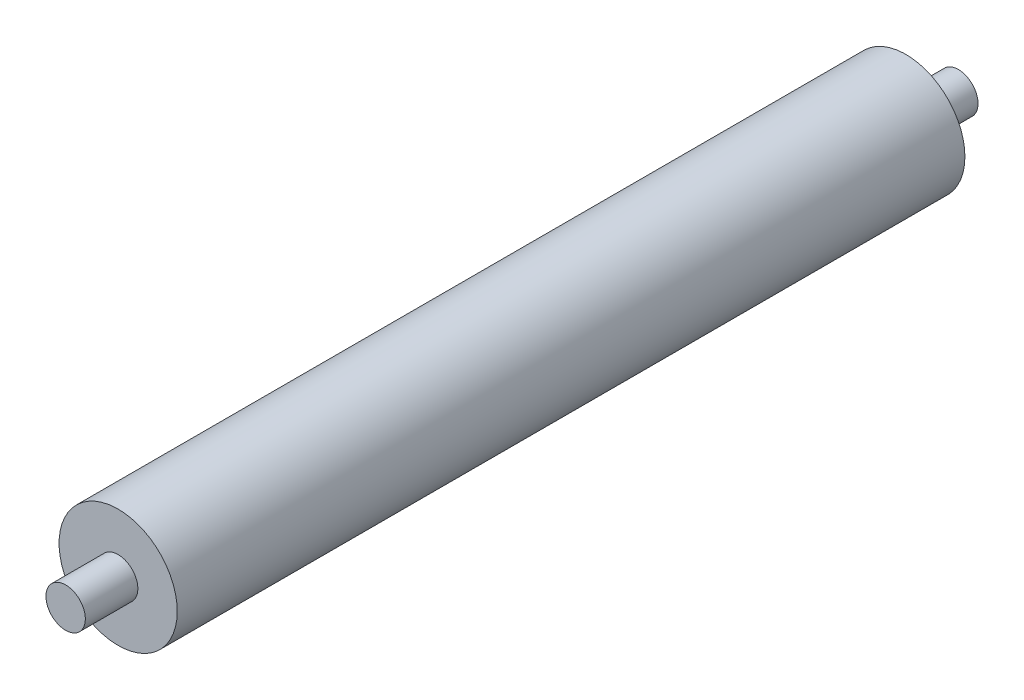
ISO-10303-21;
HEADER;
FILE_DESCRIPTION(('STEP AP214'),'2;1');
FILE_NAME('part.step','',(''),(''),'','','');
FILE_SCHEMA(('AUTOMOTIVE_DESIGN { 1 0 10303 214 1 1 1 1 }'));
ENDSEC;
DATA;
#1=APPLICATION_CONTEXT('core data for automotive mechanical design processes');
#2=APPLICATION_PROTOCOL_DEFINITION('international standard','automotive_design',2000,#1);
#3=PRODUCT_CONTEXT('',#1,'mechanical');
#4=PRODUCT('Part','Part','',(#3));
#5=PRODUCT_RELATED_PRODUCT_CATEGORY('part','',(#4));
#6=PRODUCT_DEFINITION_FORMATION('','',#4);
#7=PRODUCT_DEFINITION_CONTEXT('part definition',#1,'design');
#8=PRODUCT_DEFINITION('design','',#6,#7);
#9=PRODUCT_DEFINITION_SHAPE('','',#8);
#10=(LENGTH_UNIT() NAMED_UNIT(*) SI_UNIT(.MILLI.,.METRE.));
#11=(NAMED_UNIT(*) PLANE_ANGLE_UNIT() SI_UNIT($,.RADIAN.));
#12=(NAMED_UNIT(*) SI_UNIT($,.STERADIAN.) SOLID_ANGLE_UNIT());
#13=UNCERTAINTY_MEASURE_WITH_UNIT(LENGTH_MEASURE(1.E-05),#10,'distance_accuracy_value','');
#14=(GEOMETRIC_REPRESENTATION_CONTEXT(3) GLOBAL_UNCERTAINTY_ASSIGNED_CONTEXT((#13)) GLOBAL_UNIT_ASSIGNED_CONTEXT((#10,
#11,#12)) REPRESENTATION_CONTEXT('',''));
#15=CARTESIAN_POINT('',(0.,0.,0.));
#16=DIRECTION('',(0.,0.,1.));
#17=DIRECTION('',(1.,0.,0.));
#18=AXIS2_PLACEMENT_3D('',#15,#16,#17);
#19=CARTESIAN_POINT('',(0.,0.,300.));
#20=DIRECTION('',(0.,0.,-1.));
#21=DIRECTION('',(-1.,0.,0.));
#22=AXIS2_PLACEMENT_3D('',#19,#20,#21);
#23=CYLINDRICAL_SURFACE('',#22,22.5);
#24=CARTESIAN_POINT('',(0.,0.,300.));
#25=DIRECTION('',(0.,0.,1.));
#26=DIRECTION('',(1.,0.,0.));
#27=AXIS2_PLACEMENT_3D('',#24,#25,#26);
#28=CIRCLE('',#27,22.5);
#29=CARTESIAN_POINT('',(22.5,0.,300.));
#30=VERTEX_POINT('',#29);
#31=EDGE_CURVE('E43',#30,#30,#28,.T.);
#32=ORIENTED_EDGE('',*,*,#31,.F.);
#33=EDGE_LOOP('',(#32));
#34=FACE_BOUND('',#33,.T.);
#35=CARTESIAN_POINT('',(0.,0.,0.));
#36=DIRECTION('',(0.,0.,1.));
#37=DIRECTION('',(1.,0.,0.));
#38=AXIS2_PLACEMENT_3D('',#35,#36,#37);
#39=CIRCLE('',#38,22.5);
#40=CARTESIAN_POINT('',(22.5,0.,0.));
#41=VERTEX_POINT('',#40);
#42=EDGE_CURVE('E34',#41,#41,#39,.T.);
#43=ORIENTED_EDGE('',*,*,#42,.T.);
#44=EDGE_LOOP('',(#43));
#45=FACE_BOUND('',#44,.T.);
#46=ADVANCED_FACE('F31',(#34,#45),#23,.T.);
#47=CARTESIAN_POINT('',(0.,0.,300.));
#48=DIRECTION('',(0.,0.,1.));
#49=DIRECTION('',(1.,0.,0.));
#50=AXIS2_PLACEMENT_3D('',#47,#48,#49);
#51=PLANE('',#50);
#52=CARTESIAN_POINT('',(0.,0.,300.));
#53=DIRECTION('',(0.,0.,1.));
#54=DIRECTION('',(1.,0.,0.));
#55=AXIS2_PLACEMENT_3D('',#52,#53,#54);
#56=CIRCLE('',#55,7.5);
#57=CARTESIAN_POINT('',(7.5,0.,300.));
#58=VERTEX_POINT('',#57);
#59=EDGE_CURVE('E38',#58,#58,#56,.T.);
#60=ORIENTED_EDGE('',*,*,#59,.F.);
#61=EDGE_LOOP('',(#60));
#62=FACE_BOUND('',#61,.T.);
#63=ORIENTED_EDGE('',*,*,#31,.T.);
#64=EDGE_LOOP('',(#63));
#65=FACE_BOUND('',#64,.T.);
#66=ADVANCED_FACE('F60',(#62,#65),#51,.T.);
#67=CARTESIAN_POINT('',(0.,0.,0.));
#68=DIRECTION('',(0.,0.,1.));
#69=DIRECTION('',(1.,0.,0.));
#70=AXIS2_PLACEMENT_3D('',#67,#68,#69);
#71=PLANE('',#70);
#72=CARTESIAN_POINT('',(0.,0.,0.));
#73=DIRECTION('',(0.,0.,-1.));
#74=DIRECTION('',(-1.,0.,0.));
#75=AXIS2_PLACEMENT_3D('',#72,#73,#74);
#76=CIRCLE('',#75,7.5);
#77=CARTESIAN_POINT('',(-7.5,0.,0.));
#78=VERTEX_POINT('',#77);
#79=EDGE_CURVE('E10',#78,#78,#76,.T.);
#80=ORIENTED_EDGE('',*,*,#79,.F.);
#81=EDGE_LOOP('',(#80));
#82=FACE_BOUND('',#81,.T.);
#83=ORIENTED_EDGE('',*,*,#42,.F.);
#84=EDGE_LOOP('',(#83));
#85=FACE_BOUND('',#84,.T.);
#86=ADVANCED_FACE('F57',(#82,#85),#71,.F.);
#87=CARTESIAN_POINT('',(0.,0.,320.));
#88=DIRECTION('',(0.,0.,-1.));
#89=DIRECTION('',(-1.,0.,0.));
#90=AXIS2_PLACEMENT_3D('',#87,#88,#89);
#91=CYLINDRICAL_SURFACE('',#90,7.5);
#92=CARTESIAN_POINT('',(0.,0.,320.));
#93=DIRECTION('',(0.,0.,1.));
#94=DIRECTION('',(1.,0.,0.));
#95=AXIS2_PLACEMENT_3D('',#92,#93,#94);
#96=CIRCLE('',#95,7.5);
#97=CARTESIAN_POINT('',(7.5,0.,320.));
#98=VERTEX_POINT('',#97);
#99=EDGE_CURVE('E48',#98,#98,#96,.T.);
#100=ORIENTED_EDGE('',*,*,#99,.F.);
#101=EDGE_LOOP('',(#100));
#102=FACE_BOUND('',#101,.T.);
#103=ORIENTED_EDGE('',*,*,#59,.T.);
#104=EDGE_LOOP('',(#103));
#105=FACE_BOUND('',#104,.T.);
#106=ADVANCED_FACE('F59',(#102,#105),#91,.T.);
#107=CARTESIAN_POINT('',(0.,0.,320.));
#108=DIRECTION('',(0.,0.,1.));
#109=DIRECTION('',(1.,0.,0.));
#110=AXIS2_PLACEMENT_3D('',#107,#108,#109);
#111=PLANE('',#110);
#112=ORIENTED_EDGE('',*,*,#99,.T.);
#113=EDGE_LOOP('',(#112));
#114=FACE_BOUND('',#113,.T.);
#115=ADVANCED_FACE('F66',(#114),#111,.T.);
#116=CARTESIAN_POINT('',(0.,0.,-20.));
#117=DIRECTION('',(0.,0.,1.));
#118=DIRECTION('',(1.,0.,0.));
#119=AXIS2_PLACEMENT_3D('',#116,#117,#118);
#120=CYLINDRICAL_SURFACE('',#119,7.5);
#121=CARTESIAN_POINT('',(0.,0.,-20.));
#122=DIRECTION('',(0.,0.,-1.));
#123=DIRECTION('',(-1.,0.,0.));
#124=AXIS2_PLACEMENT_3D('',#121,#122,#123);
#125=CIRCLE('',#124,7.5);
#126=CARTESIAN_POINT('',(-7.5,0.,-20.));
#127=VERTEX_POINT('',#126);
#128=EDGE_CURVE('E47',#127,#127,#125,.T.);
#129=ORIENTED_EDGE('',*,*,#128,.F.);
#130=EDGE_LOOP('',(#129));
#131=FACE_BOUND('',#130,.T.);
#132=ORIENTED_EDGE('',*,*,#79,.T.);
#133=EDGE_LOOP('',(#132));
#134=FACE_BOUND('',#133,.T.);
#135=ADVANCED_FACE('F94',(#131,#134),#120,.T.);
#136=CARTESIAN_POINT('',(0.,0.,-20.));
#137=DIRECTION('',(0.,0.,-1.));
#138=DIRECTION('',(-1.,0.,0.));
#139=AXIS2_PLACEMENT_3D('',#136,#137,#138);
#140=PLANE('',#139);
#141=ORIENTED_EDGE('',*,*,#128,.T.);
#142=EDGE_LOOP('',(#141));
#143=FACE_BOUND('',#142,.T.);
#144=ADVANCED_FACE('F108',(#143),#140,.T.);
#145=CLOSED_SHELL('',(#46,#66,#86,#106,#115,#135,#144));
#146=MANIFOLD_SOLID_BREP('B2',#145);
#147=ADVANCED_BREP_SHAPE_REPRESENTATION('',(#18,#146),#14);
#148=SHAPE_DEFINITION_REPRESENTATION(#9,#147);
ENDSEC;
END-ISO-10303-21;
